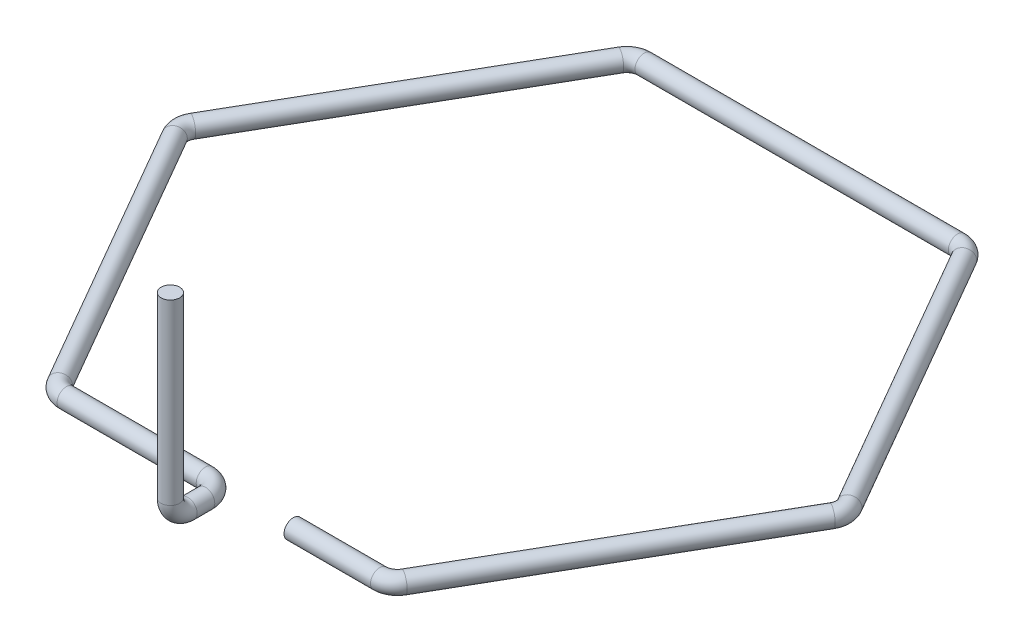
ISO-10303-21;
HEADER;
FILE_DESCRIPTION(('STEP AP214'),'2;1');
FILE_NAME('part.step','',(''),(''),'','','');
FILE_SCHEMA(('AUTOMOTIVE_DESIGN { 1 0 10303 214 1 1 1 1 }'));
ENDSEC;
DATA;
#1=APPLICATION_CONTEXT('core data for automotive mechanical design processes');
#2=APPLICATION_PROTOCOL_DEFINITION('international standard','automotive_design',2000,#1);
#3=PRODUCT_CONTEXT('',#1,'mechanical');
#4=PRODUCT('Part','Part','',(#3));
#5=PRODUCT_RELATED_PRODUCT_CATEGORY('part','',(#4));
#6=PRODUCT_DEFINITION_FORMATION('','',#4);
#7=PRODUCT_DEFINITION_CONTEXT('part definition',#1,'design');
#8=PRODUCT_DEFINITION('design','',#6,#7);
#9=PRODUCT_DEFINITION_SHAPE('','',#8);
#10=(LENGTH_UNIT() NAMED_UNIT(*) SI_UNIT(.MILLI.,.METRE.));
#11=(NAMED_UNIT(*) PLANE_ANGLE_UNIT() SI_UNIT($,.RADIAN.));
#12=(NAMED_UNIT(*) SI_UNIT($,.STERADIAN.) SOLID_ANGLE_UNIT());
#13=UNCERTAINTY_MEASURE_WITH_UNIT(LENGTH_MEASURE(1.E-05),#10,'distance_accuracy_value','');
#14=(GEOMETRIC_REPRESENTATION_CONTEXT(3) GLOBAL_UNCERTAINTY_ASSIGNED_CONTEXT((#13)) GLOBAL_UNIT_ASSIGNED_CONTEXT((#10,
#11,#12)) REPRESENTATION_CONTEXT('',''));
#15=CARTESIAN_POINT('',(0.,0.,0.));
#16=DIRECTION('',(0.,0.,1.));
#17=DIRECTION('',(1.,0.,0.));
#18=AXIS2_PLACEMENT_3D('',#15,#16,#17);
#19=CARTESIAN_POINT('',(11.9999999999995,0.,-4.50000000000014));
#20=DIRECTION('',(1.,0.,0.));
#21=DIRECTION('',(0.,0.,-1.));
#22=AXIS2_PLACEMENT_3D('',#19,#20,#21);
#23=PLANE('',#22);
#24=CARTESIAN_POINT('',(11.9999999999995,0.,-4.50000000000014));
#25=DIRECTION('',(1.,0.,0.));
#26=DIRECTION('',(0.,0.,-1.));
#27=AXIS2_PLACEMENT_3D('',#24,#25,#26);
#28=CIRCLE('',#27,1.585);
#29=CARTESIAN_POINT('',(11.9999999999995,0.,-6.08500000000014));
#30=VERTEX_POINT('',#29);
#31=EDGE_CURVE('E50',#30,#30,#28,.T.);
#32=ORIENTED_EDGE('',*,*,#31,.F.);
#33=EDGE_LOOP('',(#32));
#34=FACE_BOUND('',#33,.T.);
#35=ADVANCED_FACE('F38',(#34),#23,.F.);
#36=CARTESIAN_POINT('',(11.9999999999995,0.,-4.50000000000014));
#37=DIRECTION('',(1.,0.,0.));
#38=DIRECTION('',(0.,0.,-1.));
#39=AXIS2_PLACEMENT_3D('',#36,#37,#38);
#40=CYLINDRICAL_SURFACE('',#39,1.585);
#41=CARTESIAN_POINT('',(26.7679491924312,0.,-4.50000000000009));
#42=DIRECTION('',(1.,0.,0.));
#43=DIRECTION('',(0.,0.,-1.));
#44=AXIS2_PLACEMENT_3D('',#41,#42,#43);
#45=CIRCLE('',#44,1.585);
#46=CARTESIAN_POINT('',(26.7679491924312,0.,-2.91500000000009));
#47=VERTEX_POINT('',#46);
#48=EDGE_CURVE('E59',#47,#47,#45,.T.);
#49=ORIENTED_EDGE('',*,*,#48,.F.);
#50=EDGE_LOOP('',(#49));
#51=FACE_BOUND('',#50,.T.);
#52=ORIENTED_EDGE('',*,*,#31,.T.);
#53=EDGE_LOOP('',(#52));
#54=FACE_BOUND('',#53,.T.);
#55=ADVANCED_FACE('F174',(#51,#54),#40,.T.);
#56=CARTESIAN_POINT('',(26.7679491924313,0.,-7.50000000000009));
#57=DIRECTION('',(0.,1.,0.));
#58=DIRECTION('',(0.,0.,1.));
#59=AXIS2_PLACEMENT_3D('',#56,#57,#58);
#60=TOROIDAL_SURFACE('',#59,3.,1.585);
#61=CARTESIAN_POINT('',(29.3660254037846,0.,-6.0000000000001));
#62=DIRECTION('',(0.499999999999999,0.,-0.866025403784439));
#63=DIRECTION('',(-0.866025403784439,0.,-0.499999999999999));
#64=AXIS2_PLACEMENT_3D('',#61,#62,#63);
#65=CIRCLE('',#64,1.585);
#66=CARTESIAN_POINT('',(30.7386756687829,0.,-5.20750000000011));
#67=VERTEX_POINT('',#66);
#68=EDGE_CURVE('E68',#67,#67,#65,.T.);
#69=CARTESIAN_POINT('',(26.7679491924313,0.,-7.50000000000009));
#70=DIRECTION('',(0.,1.,0.));
#71=DIRECTION('',(0.,0.,1.));
#72=AXIS2_PLACEMENT_3D('',#69,#70,#71);
#73=CIRCLE('',#72,4.585);
#74=EDGE_CURVE('',#47,#67,#73,.T.);
#75=ORIENTED_EDGE('',*,*,#48,.T.);
#76=ORIENTED_EDGE('',*,*,#68,.F.);
#77=ORIENTED_EDGE('',*,*,#74,.T.);
#78=ORIENTED_EDGE('',*,*,#74,.F.);
#79=EDGE_LOOP('',(#75,#77,#76,#78));
#80=FACE_BOUND('',#79,.T.);
#81=ADVANCED_FACE('F168',(#80),#60,.T.);
#82=CARTESIAN_POINT('',(29.3660254037846,0.,-6.0000000000001));
#83=DIRECTION('',(0.499999999999999,0.,-0.866025403784439));
#84=DIRECTION('',(-0.866025403784439,0.,-0.499999999999999));
#85=AXIS2_PLACEMENT_3D('',#82,#83,#84);
#86=CYLINDRICAL_SURFACE('',#85,1.585);
#87=CARTESIAN_POINT('',(56.1339745962154,0.,-52.3634480157127));
#88=DIRECTION('',(0.500000000000003,0.,-0.866025403784437));
#89=DIRECTION('',(-0.866025403784437,0.,-0.500000000000003));
#90=AXIS2_PLACEMENT_3D('',#87,#88,#89);
#91=CIRCLE('',#90,1.585);
#92=CARTESIAN_POINT('',(57.5066248612137,0.,-51.5709480157127));
#93=VERTEX_POINT('',#92);
#94=EDGE_CURVE('E71',#93,#93,#91,.T.);
#95=ORIENTED_EDGE('',*,*,#94,.F.);
#96=EDGE_LOOP('',(#95));
#97=FACE_BOUND('',#96,.T.);
#98=ORIENTED_EDGE('',*,*,#68,.T.);
#99=EDGE_LOOP('',(#98));
#100=FACE_BOUND('',#99,.T.);
#101=ADVANCED_FACE('F162',(#97,#100),#86,.T.);
#102=CARTESIAN_POINT('',(53.5358983848621,0.,-53.8634480157127));
#103=DIRECTION('',(0.,1.,0.));
#104=DIRECTION('',(0.,0.,1.));
#105=AXIS2_PLACEMENT_3D('',#102,#103,#104);
#106=TOROIDAL_SURFACE('',#105,3.,1.585);
#107=CARTESIAN_POINT('',(56.1339745962154,0.,-55.3634480157127));
#108=DIRECTION('',(-0.499999999999989,0.,-0.866025403784445));
#109=DIRECTION('',(-0.866025403784445,0.,0.499999999999989));
#110=AXIS2_PLACEMENT_3D('',#107,#108,#109);
#111=CIRCLE('',#110,1.585);
#112=CARTESIAN_POINT('',(57.5066248612138,0.,-56.1559480157127));
#113=VERTEX_POINT('',#112);
#114=EDGE_CURVE('E74',#113,#113,#111,.T.);
#115=CARTESIAN_POINT('',(53.5358983848621,0.,-53.8634480157127));
#116=DIRECTION('',(0.,1.,0.));
#117=DIRECTION('',(0.,0.,1.));
#118=AXIS2_PLACEMENT_3D('',#115,#116,#117);
#119=CIRCLE('',#118,4.585);
#120=EDGE_CURVE('',#93,#113,#119,.T.);
#121=ORIENTED_EDGE('',*,*,#94,.T.);
#122=ORIENTED_EDGE('',*,*,#114,.F.);
#123=ORIENTED_EDGE('',*,*,#120,.T.);
#124=ORIENTED_EDGE('',*,*,#120,.F.);
#125=EDGE_LOOP('',(#121,#123,#122,#124));
#126=FACE_BOUND('',#125,.T.);
#127=ADVANCED_FACE('F156',(#126),#106,.T.);
#128=CARTESIAN_POINT('',(56.1339745962154,0.,-55.3634480157127));
#129=DIRECTION('',(-0.49999999999999,0.,-0.866025403784445));
#130=DIRECTION('',(-0.866025403784445,0.,0.49999999999999));
#131=AXIS2_PLACEMENT_3D('',#128,#129,#130);
#132=CYLINDRICAL_SURFACE('',#131,1.585);
#133=CARTESIAN_POINT('',(29.3660254037849,0.,-101.726896031426));
#134=DIRECTION('',(-0.499999999999986,0.,-0.866025403784447));
#135=DIRECTION('',(-0.866025403784447,0.,0.499999999999986));
#136=AXIS2_PLACEMENT_3D('',#133,#134,#135);
#137=CIRCLE('',#136,1.585);
#138=CARTESIAN_POINT('',(30.7386756687833,0.,-102.519396031426));
#139=VERTEX_POINT('',#138);
#140=EDGE_CURVE('E77',#139,#139,#137,.T.);
#141=ORIENTED_EDGE('',*,*,#140,.F.);
#142=EDGE_LOOP('',(#141));
#143=FACE_BOUND('',#142,.T.);
#144=ORIENTED_EDGE('',*,*,#114,.T.);
#145=EDGE_LOOP('',(#144));
#146=FACE_BOUND('',#145,.T.);
#147=ADVANCED_FACE('F150',(#143,#146),#132,.T.);
#148=CARTESIAN_POINT('',(26.7679491924316,0.,-100.226896031426));
#149=DIRECTION('',(0.,1.,0.));
#150=DIRECTION('',(0.,0.,1.));
#151=AXIS2_PLACEMENT_3D('',#148,#149,#150);
#152=TOROIDAL_SURFACE('',#151,2.99999999999999,1.585);
#153=CARTESIAN_POINT('',(26.7679491924316,0.,-103.226896031426));
#154=DIRECTION('',(-1.,0.,0.));
#155=DIRECTION('',(0.,0.,1.));
#156=AXIS2_PLACEMENT_3D('',#153,#154,#155);
#157=CIRCLE('',#156,1.585);
#158=CARTESIAN_POINT('',(26.7679491924316,0.,-104.811896031426));
#159=VERTEX_POINT('',#158);
#160=EDGE_CURVE('E80',#159,#159,#157,.T.);
#161=CARTESIAN_POINT('',(26.7679491924316,0.,-100.226896031426));
#162=DIRECTION('',(0.,1.,0.));
#163=DIRECTION('',(0.,0.,1.));
#164=AXIS2_PLACEMENT_3D('',#161,#162,#163);
#165=CIRCLE('',#164,4.58499999999999);
#166=EDGE_CURVE('',#139,#159,#165,.T.);
#167=ORIENTED_EDGE('',*,*,#140,.T.);
#168=ORIENTED_EDGE('',*,*,#160,.F.);
#169=ORIENTED_EDGE('',*,*,#166,.T.);
#170=ORIENTED_EDGE('',*,*,#166,.F.);
#171=EDGE_LOOP('',(#167,#169,#168,#170));
#172=FACE_BOUND('',#171,.T.);
#173=ADVANCED_FACE('F144',(#172),#152,.T.);
#174=CARTESIAN_POINT('',(26.7679491924316,0.,-103.226896031426));
#175=DIRECTION('',(-1.,0.,0.));
#176=DIRECTION('',(0.,0.,1.));
#177=AXIS2_PLACEMENT_3D('',#174,#175,#176);
#178=CYLINDRICAL_SURFACE('',#177,1.585);
#179=CARTESIAN_POINT('',(-26.7679491924305,0.,-103.226896031426));
#180=DIRECTION('',(-1.,0.,0.));
#181=DIRECTION('',(0.,0.,1.));
#182=AXIS2_PLACEMENT_3D('',#179,#180,#181);
#183=CIRCLE('',#182,1.585);
#184=CARTESIAN_POINT('',(-26.7679491924305,0.,-104.811896031426));
#185=VERTEX_POINT('',#184);
#186=EDGE_CURVE('E83',#185,#185,#183,.T.);
#187=ORIENTED_EDGE('',*,*,#186,.F.);
#188=EDGE_LOOP('',(#187));
#189=FACE_BOUND('',#188,.T.);
#190=ORIENTED_EDGE('',*,*,#160,.T.);
#191=EDGE_LOOP('',(#190));
#192=FACE_BOUND('',#191,.T.);
#193=ADVANCED_FACE('F138',(#189,#192),#178,.T.);
#194=CARTESIAN_POINT('',(-26.7679491924306,0.,-100.226896031426));
#195=DIRECTION('',(0.,1.,0.));
#196=DIRECTION('',(0.,0.,1.));
#197=AXIS2_PLACEMENT_3D('',#194,#195,#196);
#198=TOROIDAL_SURFACE('',#197,3.,1.585);
#199=CARTESIAN_POINT('',(-29.3660254037839,0.,-101.726896031426));
#200=DIRECTION('',(-0.500000000000005,0.,0.866025403784436));
#201=DIRECTION('',(0.866025403784436,0.,0.500000000000005));
#202=AXIS2_PLACEMENT_3D('',#199,#200,#201);
#203=CIRCLE('',#202,1.585);
#204=CARTESIAN_POINT('',(-30.7386756687822,0.,-102.519396031426));
#205=VERTEX_POINT('',#204);
#206=EDGE_CURVE('E86',#205,#205,#203,.T.);
#207=CARTESIAN_POINT('',(-26.7679491924306,0.,-100.226896031426));
#208=DIRECTION('',(0.,1.,0.));
#209=DIRECTION('',(0.,0.,1.));
#210=AXIS2_PLACEMENT_3D('',#207,#208,#209);
#211=CIRCLE('',#210,4.585);
#212=EDGE_CURVE('',#185,#205,#211,.T.);
#213=ORIENTED_EDGE('',*,*,#186,.T.);
#214=ORIENTED_EDGE('',*,*,#206,.F.);
#215=ORIENTED_EDGE('',*,*,#212,.T.);
#216=ORIENTED_EDGE('',*,*,#212,.F.);
#217=EDGE_LOOP('',(#213,#215,#214,#216));
#218=FACE_BOUND('',#217,.T.);
#219=ADVANCED_FACE('F132',(#218),#198,.T.);
#220=CARTESIAN_POINT('',(-29.3660254037839,0.,-101.726896031426));
#221=DIRECTION('',(-0.500000000000007,0.,0.866025403784434));
#222=DIRECTION('',(0.866025403784434,0.,0.500000000000007));
#223=AXIS2_PLACEMENT_3D('',#220,#221,#222);
#224=CYLINDRICAL_SURFACE('',#223,1.585);
#225=CARTESIAN_POINT('',(-56.1339745962154,0.,-55.3634480157134));
#226=DIRECTION('',(-0.500000000000011,0.,0.866025403784432));
#227=DIRECTION('',(0.866025403784432,0.,0.500000000000011));
#228=AXIS2_PLACEMENT_3D('',#225,#226,#227);
#229=CIRCLE('',#228,1.585);
#230=CARTESIAN_POINT('',(-57.5066248612137,0.,-56.1559480157134));
#231=VERTEX_POINT('',#230);
#232=EDGE_CURVE('E89',#231,#231,#229,.T.);
#233=ORIENTED_EDGE('',*,*,#232,.F.);
#234=EDGE_LOOP('',(#233));
#235=FACE_BOUND('',#234,.T.);
#236=ORIENTED_EDGE('',*,*,#206,.T.);
#237=EDGE_LOOP('',(#236));
#238=FACE_BOUND('',#237,.T.);
#239=ADVANCED_FACE('F126',(#235,#238),#224,.T.);
#240=CARTESIAN_POINT('',(-53.5358983848621,0.,-53.8634480157133));
#241=DIRECTION('',(0.,1.,0.));
#242=DIRECTION('',(0.,0.,1.));
#243=AXIS2_PLACEMENT_3D('',#240,#241,#242);
#244=TOROIDAL_SURFACE('',#243,3.,1.585);
#245=CARTESIAN_POINT('',(-56.1339745962154,0.,-52.3634480157133));
#246=DIRECTION('',(0.500000000000001,0.,0.866025403784438));
#247=DIRECTION('',(0.866025403784438,0.,-0.500000000000001));
#248=AXIS2_PLACEMENT_3D('',#245,#246,#247);
#249=CIRCLE('',#248,1.585);
#250=CARTESIAN_POINT('',(-57.5066248612137,0.,-51.5709480157133));
#251=VERTEX_POINT('',#250);
#252=EDGE_CURVE('E92',#251,#251,#249,.T.);
#253=CARTESIAN_POINT('',(-53.5358983848621,0.,-53.8634480157133));
#254=DIRECTION('',(0.,1.,0.));
#255=DIRECTION('',(0.,0.,1.));
#256=AXIS2_PLACEMENT_3D('',#253,#254,#255);
#257=CIRCLE('',#256,4.585);
#258=EDGE_CURVE('',#231,#251,#257,.T.);
#259=ORIENTED_EDGE('',*,*,#232,.T.);
#260=ORIENTED_EDGE('',*,*,#252,.F.);
#261=ORIENTED_EDGE('',*,*,#258,.T.);
#262=ORIENTED_EDGE('',*,*,#258,.F.);
#263=EDGE_LOOP('',(#259,#261,#260,#262));
#264=FACE_BOUND('',#263,.T.);
#265=ADVANCED_FACE('F120',(#264),#244,.T.);
#266=CARTESIAN_POINT('',(-56.1339745962154,0.,-52.3634480157133));
#267=DIRECTION('',(0.500000000000001,0.,0.866025403784438));
#268=DIRECTION('',(0.866025403784438,0.,-0.500000000000001));
#269=AXIS2_PLACEMENT_3D('',#266,#267,#268);
#270=CYLINDRICAL_SURFACE('',#269,1.585);
#271=CARTESIAN_POINT('',(-29.3660254037842,0.,-6.00000000000029));
#272=DIRECTION('',(0.499999999999997,0.,0.86602540378444));
#273=DIRECTION('',(0.86602540378444,0.,-0.499999999999997));
#274=AXIS2_PLACEMENT_3D('',#271,#272,#273);
#275=CIRCLE('',#274,1.585);
#276=CARTESIAN_POINT('',(-30.7386756687825,0.,-5.2075000000003));
#277=VERTEX_POINT('',#276);
#278=EDGE_CURVE('E95',#277,#277,#275,.T.);
#279=ORIENTED_EDGE('',*,*,#278,.F.);
#280=EDGE_LOOP('',(#279));
#281=FACE_BOUND('',#280,.T.);
#282=ORIENTED_EDGE('',*,*,#252,.T.);
#283=EDGE_LOOP('',(#282));
#284=FACE_BOUND('',#283,.T.);
#285=ADVANCED_FACE('F114',(#281,#284),#270,.T.);
#286=CARTESIAN_POINT('',(-26.7679491924309,0.,-7.50000000000028));
#287=DIRECTION('',(0.,1.,0.));
#288=DIRECTION('',(0.,0.,1.));
#289=AXIS2_PLACEMENT_3D('',#286,#287,#288);
#290=TOROIDAL_SURFACE('',#289,3.,1.585);
#291=CARTESIAN_POINT('',(-26.7679491924309,0.,-4.50000000000028));
#292=DIRECTION('',(1.,0.,0.));
#293=DIRECTION('',(0.,0.,-1.));
#294=AXIS2_PLACEMENT_3D('',#291,#292,#293);
#295=CIRCLE('',#294,1.585);
#296=CARTESIAN_POINT('',(-26.7679491924309,0.,-2.91500000000028));
#297=VERTEX_POINT('',#296);
#298=EDGE_CURVE('E98',#297,#297,#295,.T.);
#299=CARTESIAN_POINT('',(-26.7679491924309,0.,-7.50000000000028));
#300=DIRECTION('',(0.,1.,0.));
#301=DIRECTION('',(0.,0.,1.));
#302=AXIS2_PLACEMENT_3D('',#299,#300,#301);
#303=CIRCLE('',#302,4.585);
#304=EDGE_CURVE('',#277,#297,#303,.T.);
#305=ORIENTED_EDGE('',*,*,#278,.T.);
#306=ORIENTED_EDGE('',*,*,#298,.F.);
#307=ORIENTED_EDGE('',*,*,#304,.T.);
#308=ORIENTED_EDGE('',*,*,#304,.F.);
#309=EDGE_LOOP('',(#305,#307,#306,#308));
#310=FACE_BOUND('',#309,.T.);
#311=ADVANCED_FACE('F108',(#310),#290,.T.);
#312=CARTESIAN_POINT('',(-26.7679491924309,0.,-4.50000000000028));
#313=DIRECTION('',(1.,0.,0.));
#314=DIRECTION('',(0.,0.,-1.));
#315=AXIS2_PLACEMENT_3D('',#312,#313,#314);
#316=CYLINDRICAL_SURFACE('',#315,1.585);
#317=CARTESIAN_POINT('',(-3.,0.,-4.50000000000003));
#318=DIRECTION('',(1.,0.,0.));
#319=DIRECTION('',(0.,0.,-1.));
#320=AXIS2_PLACEMENT_3D('',#317,#318,#319);
#321=CIRCLE('',#320,1.585);
#322=CARTESIAN_POINT('',(-2.99999999999999,0.,-6.08500000000003));
#323=VERTEX_POINT('',#322);
#324=EDGE_CURVE('E45',#323,#323,#321,.T.);
#325=ORIENTED_EDGE('',*,*,#324,.F.);
#326=EDGE_LOOP('',(#325));
#327=FACE_BOUND('',#326,.T.);
#328=ORIENTED_EDGE('',*,*,#298,.T.);
#329=EDGE_LOOP('',(#328));
#330=FACE_BOUND('',#329,.T.);
#331=ADVANCED_FACE('F105',(#327,#330),#316,.T.);
#332=CARTESIAN_POINT('',(-3.00000000000001,0.,-1.50000000000003));
#333=DIRECTION('',(0.,-1.,0.));
#334=DIRECTION('',(0.,0.,-1.));
#335=AXIS2_PLACEMENT_3D('',#332,#333,#334);
#336=TOROIDAL_SURFACE('',#335,3.,1.585);
#337=CARTESIAN_POINT('',(0.,0.,-1.50000000000003));
#338=DIRECTION('',(0.,0.,1.));
#339=DIRECTION('',(1.,0.,0.));
#340=AXIS2_PLACEMENT_3D('',#337,#338,#339);
#341=CIRCLE('',#340,1.585);
#342=CARTESIAN_POINT('',(1.58499999999999,0.,-1.50000000000003));
#343=VERTEX_POINT('',#342);
#344=EDGE_CURVE('E12',#343,#343,#341,.T.);
#345=CARTESIAN_POINT('',(-3.00000000000001,0.,-1.50000000000003));
#346=DIRECTION('',(0.,-1.,0.));
#347=DIRECTION('',(0.,0.,-1.));
#348=AXIS2_PLACEMENT_3D('',#345,#346,#347);
#349=CIRCLE('',#348,4.585);
#350=EDGE_CURVE('',#323,#343,#349,.T.);
#351=ORIENTED_EDGE('',*,*,#324,.T.);
#352=ORIENTED_EDGE('',*,*,#344,.F.);
#353=ORIENTED_EDGE('',*,*,#350,.T.);
#354=ORIENTED_EDGE('',*,*,#350,.F.);
#355=EDGE_LOOP('',(#351,#353,#352,#354));
#356=FACE_BOUND('',#355,.T.);
#357=ADVANCED_FACE('F103',(#356),#336,.T.);
#358=CARTESIAN_POINT('',(0.,0.,-1.50000000000003));
#359=DIRECTION('',(0.,0.,1.));
#360=DIRECTION('',(1.,0.,0.));
#361=AXIS2_PLACEMENT_3D('',#358,#359,#360);
#362=CYLINDRICAL_SURFACE('',#361,1.585);
#363=ORIENTED_EDGE('',*,*,#344,.T.);
#364=EDGE_LOOP('',(#363));
#365=FACE_BOUND('',#364,.T.);
#366=CARTESIAN_POINT('',(0.,0.,1.49999999999998));
#367=DIRECTION('',(0.,0.,1.));
#368=DIRECTION('',(1.,0.,0.));
#369=AXIS2_PLACEMENT_3D('',#366,#367,#368);
#370=CIRCLE('',#369,1.585);
#371=CARTESIAN_POINT('',(0.,-1.585,1.49999999999997));
#372=VERTEX_POINT('',#371);
#373=EDGE_CURVE('E62',#372,#372,#370,.T.);
#374=ORIENTED_EDGE('',*,*,#373,.F.);
#375=EDGE_LOOP('',(#374));
#376=FACE_BOUND('',#375,.T.);
#377=ADVANCED_FACE('F186',(#365,#376),#362,.T.);
#378=CARTESIAN_POINT('',(0.,33.4,4.5));
#379=DIRECTION('',(0.,1.,0.));
#380=DIRECTION('',(1.,0.,0.));
#381=AXIS2_PLACEMENT_3D('',#378,#379,#380);
#382=PLANE('',#381);
#383=CARTESIAN_POINT('',(0.,33.4,4.5));
#384=DIRECTION('',(0.,1.,0.));
#385=DIRECTION('',(1.,0.,0.));
#386=AXIS2_PLACEMENT_3D('',#383,#384,#385);
#387=CIRCLE('',#386,1.585);
#388=CARTESIAN_POINT('',(1.585,33.4,4.5));
#389=VERTEX_POINT('',#388);
#390=EDGE_CURVE('E54',#389,#389,#387,.T.);
#391=ORIENTED_EDGE('',*,*,#390,.T.);
#392=EDGE_LOOP('',(#391));
#393=FACE_BOUND('',#392,.T.);
#394=ADVANCED_FACE('F55',(#393),#382,.T.);
#395=CARTESIAN_POINT('',(0.,3.,1.5));
#396=DIRECTION('',(-1.,0.,0.));
#397=DIRECTION('',(0.,0.,1.));
#398=AXIS2_PLACEMENT_3D('',#395,#396,#397);
#399=TOROIDAL_SURFACE('',#398,3.,1.585);
#400=CARTESIAN_POINT('',(0.,3.,4.5));
#401=DIRECTION('',(0.,1.,0.));
#402=DIRECTION('',(1.,0.,0.));
#403=AXIS2_PLACEMENT_3D('',#400,#401,#402);
#404=CIRCLE('',#403,1.585);
#405=CARTESIAN_POINT('',(0.,3.,6.085));
#406=VERTEX_POINT('',#405);
#407=EDGE_CURVE('E57',#406,#406,#404,.T.);
#408=CARTESIAN_POINT('',(0.,3.,1.5));
#409=DIRECTION('',(-1.,0.,0.));
#410=DIRECTION('',(0.,0.,1.));
#411=AXIS2_PLACEMENT_3D('',#408,#409,#410);
#412=CIRCLE('',#411,4.585);
#413=EDGE_CURVE('',#372,#406,#412,.T.);
#414=ORIENTED_EDGE('',*,*,#373,.T.);
#415=ORIENTED_EDGE('',*,*,#407,.F.);
#416=ORIENTED_EDGE('',*,*,#413,.T.);
#417=ORIENTED_EDGE('',*,*,#413,.F.);
#418=EDGE_LOOP('',(#414,#416,#415,#417));
#419=FACE_BOUND('',#418,.T.);
#420=ADVANCED_FACE('F193',(#419),#399,.T.);
#421=CARTESIAN_POINT('',(0.,3.,4.5));
#422=DIRECTION('',(0.,1.,0.));
#423=DIRECTION('',(0.,0.,1.));
#424=AXIS2_PLACEMENT_3D('',#421,#422,#423);
#425=CYLINDRICAL_SURFACE('',#424,1.585);
#426=ORIENTED_EDGE('',*,*,#390,.F.);
#427=EDGE_LOOP('',(#426));
#428=FACE_BOUND('',#427,.T.);
#429=ORIENTED_EDGE('',*,*,#407,.T.);
#430=EDGE_LOOP('',(#429));
#431=FACE_BOUND('',#430,.T.);
#432=ADVANCED_FACE('F184',(#428,#431),#425,.T.);
#433=CLOSED_SHELL('',(#35,#55,#81,#101,#127,#147,#173,#193,#219,#239,#265,#285,#311,#331,#357,
#377,#394,#420,#432));
#434=MANIFOLD_SOLID_BREP('B2',#433);
#435=ADVANCED_BREP_SHAPE_REPRESENTATION('',(#18,#434),#14);
#436=SHAPE_DEFINITION_REPRESENTATION(#9,#435);
ENDSEC;
END-ISO-10303-21;
